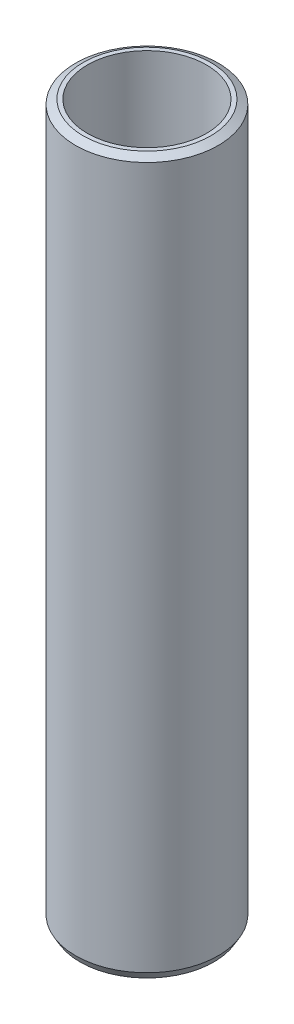
ISO-10303-21;
HEADER;
FILE_DESCRIPTION(('STEP AP214'),'2;1');
FILE_NAME('part.step','',(''),(''),'','','');
FILE_SCHEMA(('AUTOMOTIVE_DESIGN { 1 0 10303 214 1 1 1 1 }'));
ENDSEC;
DATA;
#1=APPLICATION_CONTEXT('core data for automotive mechanical design processes');
#2=APPLICATION_PROTOCOL_DEFINITION('international standard','automotive_design',2000,#1);
#3=PRODUCT_CONTEXT('',#1,'mechanical');
#4=PRODUCT('Part','Part','',(#3));
#5=PRODUCT_RELATED_PRODUCT_CATEGORY('part','',(#4));
#6=PRODUCT_DEFINITION_FORMATION('','',#4);
#7=PRODUCT_DEFINITION_CONTEXT('part definition',#1,'design');
#8=PRODUCT_DEFINITION('design','',#6,#7);
#9=PRODUCT_DEFINITION_SHAPE('','',#8);
#10=(LENGTH_UNIT() NAMED_UNIT(*) SI_UNIT(.MILLI.,.METRE.));
#11=(NAMED_UNIT(*) PLANE_ANGLE_UNIT() SI_UNIT($,.RADIAN.));
#12=(NAMED_UNIT(*) SI_UNIT($,.STERADIAN.) SOLID_ANGLE_UNIT());
#13=UNCERTAINTY_MEASURE_WITH_UNIT(LENGTH_MEASURE(1.E-05),#10,'distance_accuracy_value','');
#14=(GEOMETRIC_REPRESENTATION_CONTEXT(3) GLOBAL_UNCERTAINTY_ASSIGNED_CONTEXT((#13)) GLOBAL_UNIT_ASSIGNED_CONTEXT((#10,
#11,#12)) REPRESENTATION_CONTEXT('',''));
#15=CARTESIAN_POINT('',(0.,0.,0.));
#16=DIRECTION('',(0.,0.,1.));
#17=DIRECTION('',(1.,0.,0.));
#18=AXIS2_PLACEMENT_3D('',#15,#16,#17);
#19=CARTESIAN_POINT('',(0.,600.,0.));
#20=DIRECTION('',(0.,-1.,0.));
#21=DIRECTION('',(0.,0.,-1.));
#22=AXIS2_PLACEMENT_3D('',#19,#20,#21);
#23=CYLINDRICAL_SURFACE('',#22,60.);
#24=CARTESIAN_POINT('',(0.,596.267040167131,0.));
#25=DIRECTION('',(0.,1.,0.));
#26=DIRECTION('',(0.,0.,1.));
#27=AXIS2_PLACEMENT_3D('',#24,#25,#26);
#28=CIRCLE('',#27,60.);
#29=CARTESIAN_POINT('',(0.,596.267040167131,60.));
#30=VERTEX_POINT('',#29);
#31=EDGE_CURVE('E50',#30,#30,#28,.F.);
#32=ORIENTED_EDGE('',*,*,#31,.T.);
#33=EDGE_LOOP('',(#32));
#34=FACE_BOUND('',#33,.T.);
#35=CARTESIAN_POINT('',(0.,6.46567609314208,0.));
#36=DIRECTION('',(0.,1.,0.));
#37=DIRECTION('',(0.,0.,1.));
#38=AXIS2_PLACEMENT_3D('',#35,#36,#37);
#39=CIRCLE('',#38,60.);
#40=CARTESIAN_POINT('',(0.,6.46567609314208,60.));
#41=VERTEX_POINT('',#40);
#42=EDGE_CURVE('E51',#41,#41,#39,.T.);
#43=ORIENTED_EDGE('',*,*,#42,.T.);
#44=EDGE_LOOP('',(#43));
#45=FACE_BOUND('',#44,.T.);
#46=ADVANCED_FACE('F39',(#34,#45),#23,.T.);
#47=CARTESIAN_POINT('',(0.,600.,0.));
#48=DIRECTION('',(0.,1.,0.));
#49=DIRECTION('',(0.,0.,1.));
#50=AXIS2_PLACEMENT_3D('',#47,#48,#49);
#51=PLANE('',#50);
#52=CARTESIAN_POINT('',(0.,600.,0.));
#53=DIRECTION('',(0.,1.,0.));
#54=DIRECTION('',(0.,0.,1.));
#55=AXIS2_PLACEMENT_3D('',#52,#53,#54);
#56=CIRCLE('',#55,53.5343239068579);
#57=CARTESIAN_POINT('',(0.,600.,53.5343239068579));
#58=VERTEX_POINT('',#57);
#59=EDGE_CURVE('E54',#58,#58,#56,.T.);
#60=ORIENTED_EDGE('',*,*,#59,.T.);
#61=EDGE_LOOP('',(#60));
#62=FACE_BOUND('',#61,.T.);
#63=CARTESIAN_POINT('',(0.,600.,0.));
#64=DIRECTION('',(0.,1.,0.));
#65=DIRECTION('',(0.,0.,1.));
#66=AXIS2_PLACEMENT_3D('',#63,#64,#65);
#67=CIRCLE('',#66,49.9955796523948);
#68=CARTESIAN_POINT('',(0.,600.,49.9955796523948));
#69=VERTEX_POINT('',#68);
#70=EDGE_CURVE('E58',#69,#69,#67,.T.);
#71=ORIENTED_EDGE('',*,*,#70,.F.);
#72=EDGE_LOOP('',(#71));
#73=FACE_BOUND('',#72,.T.);
#74=ADVANCED_FACE('F69',(#62,#73),#51,.T.);
#75=CARTESIAN_POINT('',(0.,0.,0.));
#76=DIRECTION('',(0.,1.,0.));
#77=DIRECTION('',(0.,0.,1.));
#78=AXIS2_PLACEMENT_3D('',#75,#76,#77);
#79=PLANE('',#78);
#80=CARTESIAN_POINT('',(0.,0.,0.));
#81=DIRECTION('',(0.,1.,0.));
#82=DIRECTION('',(0.,0.,1.));
#83=AXIS2_PLACEMENT_3D('',#80,#81,#82);
#84=CIRCLE('',#83,56.2670401671314);
#85=CARTESIAN_POINT('',(0.,0.,56.2670401671314));
#86=VERTEX_POINT('',#85);
#87=EDGE_CURVE('E10',#86,#86,#84,.F.);
#88=ORIENTED_EDGE('',*,*,#87,.T.);
#89=EDGE_LOOP('',(#88));
#90=FACE_BOUND('',#89,.T.);
#91=CARTESIAN_POINT('',(0.,0.,0.));
#92=DIRECTION('',(0.,1.,0.));
#93=DIRECTION('',(0.,0.,1.));
#94=AXIS2_PLACEMENT_3D('',#91,#92,#93);
#95=CIRCLE('',#94,49.9955796523948);
#96=CARTESIAN_POINT('',(0.,0.,49.9955796523948));
#97=VERTEX_POINT('',#96);
#98=EDGE_CURVE('E63',#97,#97,#95,.T.);
#99=ORIENTED_EDGE('',*,*,#98,.T.);
#100=EDGE_LOOP('',(#99));
#101=FACE_BOUND('',#100,.T.);
#102=ADVANCED_FACE('F75',(#90,#101),#79,.F.);
#103=CARTESIAN_POINT('',(0.,600.,0.));
#104=DIRECTION('',(0.,-1.,0.));
#105=DIRECTION('',(0.,0.,-1.));
#106=AXIS2_PLACEMENT_3D('',#103,#104,#105);
#107=CYLINDRICAL_SURFACE('',#106,49.9955796523948);
#108=ORIENTED_EDGE('',*,*,#70,.T.);
#109=EDGE_LOOP('',(#108));
#110=FACE_BOUND('',#109,.T.);
#111=ORIENTED_EDGE('',*,*,#98,.F.);
#112=EDGE_LOOP('',(#111));
#113=FACE_BOUND('',#112,.T.);
#114=ADVANCED_FACE('F70',(#110,#113),#107,.F.);
#115=CARTESIAN_POINT('',(0.,600.,0.));
#116=DIRECTION('',(0.,-1.,0.));
#117=DIRECTION('',(0.,0.,-1.));
#118=AXIS2_PLACEMENT_3D('',#115,#116,#117);
#119=CONICAL_SURFACE('',#118,53.5343239068579,1.04719755119659);
#120=ORIENTED_EDGE('',*,*,#31,.F.);
#121=EDGE_LOOP('',(#120));
#122=FACE_BOUND('',#121,.T.);
#123=ORIENTED_EDGE('',*,*,#59,.F.);
#124=EDGE_LOOP('',(#123));
#125=FACE_BOUND('',#124,.T.);
#126=ADVANCED_FACE('F81',(#122,#125),#119,.T.);
#127=CARTESIAN_POINT('',(0.,6.46567609314208,0.));
#128=DIRECTION('',(0.,1.,0.));
#129=DIRECTION('',(0.,0.,1.));
#130=AXIS2_PLACEMENT_3D('',#127,#128,#129);
#131=CONICAL_SURFACE('',#130,60.,0.523598775598308);
#132=CARTESIAN_POINT('',(0.,0.,56.2670401671314));
#133=CARTESIAN_POINT('',(0.,0.0673507926368958,56.3059251653905));
#134=CARTESIAN_POINT('',(0.,0.134701585273793,56.3448101636495));
#135=CARTESIAN_POINT('',(0.,0.269403170547586,56.4225801601676));
#136=CARTESIAN_POINT('',(0.,0.336753963184482,56.4614651584266));
#137=CARTESIAN_POINT('',(0.,0.471455548458276,56.5392351549447));
#138=CARTESIAN_POINT('',(0.,0.538806341095173,56.5781201532038));
#139=CARTESIAN_POINT('',(0.,0.673507926368966,56.6558901497219));
#140=CARTESIAN_POINT('',(0.,0.740858719005863,56.6947751479809));
#141=CARTESIAN_POINT('',(0.,0.875560304279656,56.772545144499));
#142=CARTESIAN_POINT('',(0.,0.942911096916553,56.8114301427581));
#143=CARTESIAN_POINT('',(0.,1.07761268219035,56.8892001392762));
#144=CARTESIAN_POINT('',(0.,1.14496347482724,56.9280851375352));
#145=CARTESIAN_POINT('',(0.,1.27966506010104,57.0058551340533));
#146=CARTESIAN_POINT('',(0.,1.34701585273793,57.0447401323124));
#147=CARTESIAN_POINT('',(0.,1.48171743801173,57.1225101288305));
#148=CARTESIAN_POINT('',(0.,1.54906823064862,57.1613951270895));
#149=CARTESIAN_POINT('',(0.,1.68376981592242,57.2391651236076));
#150=CARTESIAN_POINT('',(0.,1.75112060855931,57.2780501218667));
#151=CARTESIAN_POINT('',(0.,1.88582219383311,57.3558201183847));
#152=CARTESIAN_POINT('',(0.,1.95317298647,57.3947051166438));
#153=CARTESIAN_POINT('',(0.,2.0878745717438,57.4724751131619));
#154=CARTESIAN_POINT('',(0.,2.15522536438069,57.5113601114209));
#155=CARTESIAN_POINT('',(0.,2.28992694965449,57.589130107939));
#156=CARTESIAN_POINT('',(0.,2.35727774229138,57.6280151061981));
#157=CARTESIAN_POINT('',(0.,2.49197932756518,57.7057851027162));
#158=CARTESIAN_POINT('',(0.,2.55933012020207,57.7446701009752));
#159=CARTESIAN_POINT('',(0.,2.69403170547587,57.8224400974933));
#160=CARTESIAN_POINT('',(0.,2.76138249811276,57.8613250957524));
#161=CARTESIAN_POINT('',(0.,2.89608408338656,57.9390950922705));
#162=CARTESIAN_POINT('',(0.,2.96343487602345,57.9779800905295));
#163=CARTESIAN_POINT('',(0.,3.09813646129725,58.0557500870476));
#164=CARTESIAN_POINT('',(0.,3.16548725393414,58.0946350853067));
#165=CARTESIAN_POINT('',(0.,3.30018883920794,58.1724050818247));
#166=CARTESIAN_POINT('',(0.,3.36753963184483,58.2112900800838));
#167=CARTESIAN_POINT('',(0.,3.50224121711863,58.2890600766019));
#168=CARTESIAN_POINT('',(0.,3.56959200975552,58.3279450748609));
#169=CARTESIAN_POINT('',(0.,3.70429359502932,58.405715071379));
#170=CARTESIAN_POINT('',(0.,3.77164438766621,58.4446000696381));
#171=CARTESIAN_POINT('',(0.,3.90634597294001,58.5223700661562));
#172=CARTESIAN_POINT('',(0.,3.9736967655769,58.5612550644152));
#173=CARTESIAN_POINT('',(0.,4.1083983508507,58.6390250609333));
#174=CARTESIAN_POINT('',(0.,4.17574914348759,58.6779100591924));
#175=CARTESIAN_POINT('',(0.,4.31045072876139,58.7556800557105));
#176=CARTESIAN_POINT('',(0.,4.37780152139828,58.7945650539695));
#177=CARTESIAN_POINT('',(0.,4.51250310667208,58.8723350504876));
#178=CARTESIAN_POINT('',(0.,4.57985389930897,58.9112200487467));
#179=CARTESIAN_POINT('',(0.,4.71455548458277,58.9889900452648));
#180=CARTESIAN_POINT('',(0.,4.78190627721966,59.0278750435238));
#181=CARTESIAN_POINT('',(0.,4.91660786249346,59.1056450400419));
#182=CARTESIAN_POINT('',(0.,4.98395865513035,59.1445300383009));
#183=CARTESIAN_POINT('',(0.,5.11866024040415,59.222300034819));
#184=CARTESIAN_POINT('',(0.,5.18601103304104,59.2611850330781));
#185=CARTESIAN_POINT('',(0.,5.32071261831484,59.3389550295962));
#186=CARTESIAN_POINT('',(0.,5.38806341095173,59.3778400278552));
#187=CARTESIAN_POINT('',(0.,5.52276499622553,59.4556100243733));
#188=CARTESIAN_POINT('',(0.,5.59011578886242,59.4944950226324));
#189=CARTESIAN_POINT('',(0.,5.72481737413622,59.5722650191505));
#190=CARTESIAN_POINT('',(0.,5.79216816677311,59.6111500174095));
#191=CARTESIAN_POINT('',(0.,5.92686975204691,59.6889200139276));
#192=CARTESIAN_POINT('',(0.,5.9942205446838,59.7278050121867));
#193=CARTESIAN_POINT('',(0.,6.1289221299576,59.8055750087048));
#194=CARTESIAN_POINT('',(0.,6.19627292259449,59.8444600069638));
#195=CARTESIAN_POINT('',(0.,6.33097450786829,59.9222300034819));
#196=CARTESIAN_POINT('',(0.,6.39832530050518,59.9611150017409));
#197=CARTESIAN_POINT('',(0.,6.46567609314208,60.));
#198=B_SPLINE_CURVE_WITH_KNOTS('',3,(#132,#133,#134,#135,#136,#137,#138,#139,#140,#141,#142,
#143,#144,#145,#146,#147,#148,#149,#150,#151,#152,#153,#154,#155,#156,#157,#158,#159,#160,#161,
#162,#163,#164,#165,#166,#167,#168,#169,#170,#171,#172,#173,#174,#175,#176,#177,#178,#179,#180,
#181,#182,#183,#184,#185,#186,#187,#188,#189,#190,#191,#192,#193,#194,#195,#196,#197),
.UNSPECIFIED.,.F.,.F.,(4,2,2,2,2,2,2,2,2,2,2,2,2,2,2,2,2,2,2,2,2,2,2,2,2,2,2,2,2,2,2,2,4),(0.,
0.233309989554283,0.466619979108566,0.699929968662849,0.933239958217132,1.16654994777141,
1.3998599373257,1.63316992687998,1.86647991643426,2.09978990598855,2.33309989554283,
2.56640988509711,2.7997198746514,3.03302986420568,3.26633985375996,3.49964984331424,
3.73295983286853,3.96626982242281,4.19957981197709,4.43288980153138,4.66619979108566,
4.89950978063994,5.13281977019423,5.36612975974851,5.59943974930279,5.83274973885708,
6.06605972841136,6.29936971796564,6.53267970751993,6.76598969707421,6.99929968662849,
7.23260967618278,7.46591966573706),.UNSPECIFIED.);
#199=EDGE_CURVE('BSEAM45',#86,#41,#198,.T.);
#200=ORIENTED_EDGE('',*,*,#87,.F.);
#201=ORIENTED_EDGE('',*,*,#42,.F.);
#202=ORIENTED_EDGE('',*,*,#199,.T.);
#203=ORIENTED_EDGE('',*,*,#199,.F.);
#204=EDGE_LOOP('',(#200,#202,#201,#203));
#205=FACE_BOUND('',#204,.T.);
#206=ADVANCED_FACE('F45',(#205),#131,.T.);
#207=CLOSED_SHELL('',(#46,#74,#102,#114,#126,#206));
#208=MANIFOLD_SOLID_BREP('B2',#207);
#209=ADVANCED_BREP_SHAPE_REPRESENTATION('',(#18,#208),#14);
#210=SHAPE_DEFINITION_REPRESENTATION(#9,#209);
ENDSEC;
END-ISO-10303-21;
